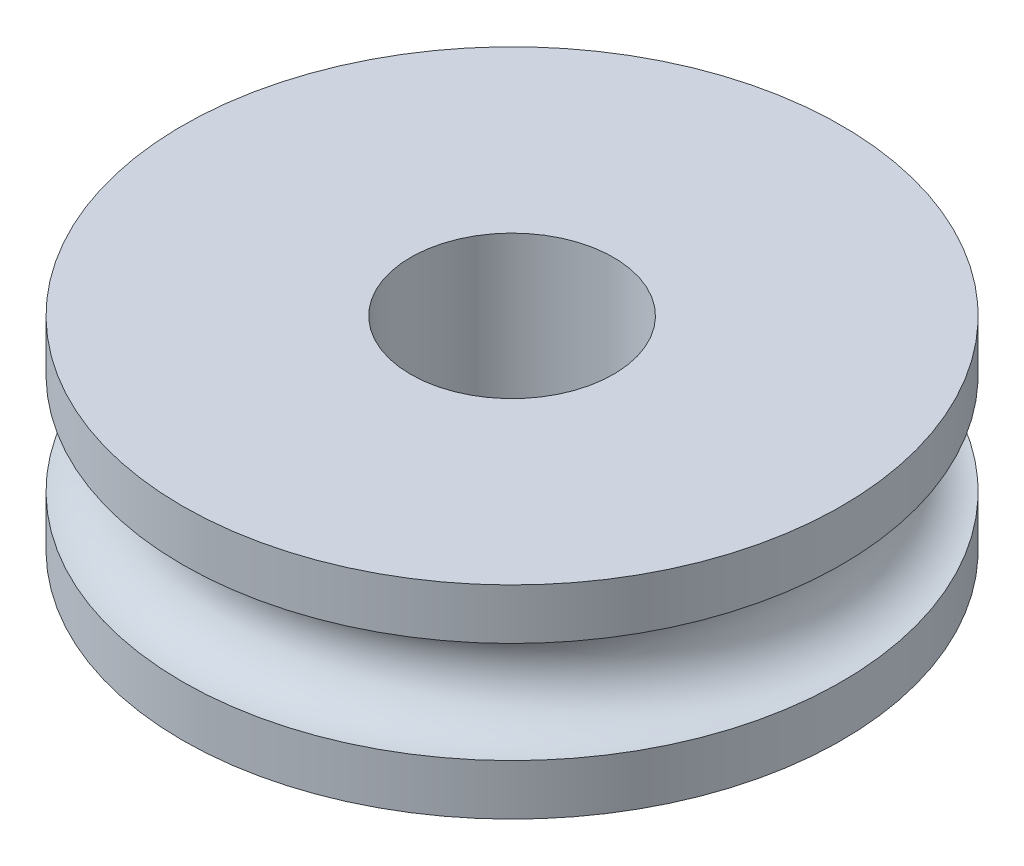
ISO-10303-21;
HEADER;
FILE_DESCRIPTION(('STEP AP214'),'2;1');
FILE_NAME('part.step','',(''),(''),'','','');
FILE_SCHEMA(('AUTOMOTIVE_DESIGN { 1 0 10303 214 1 1 1 1 }'));
ENDSEC;
DATA;
#1=APPLICATION_CONTEXT('core data for automotive mechanical design processes');
#2=APPLICATION_PROTOCOL_DEFINITION('international standard','automotive_design',2000,#1);
#3=PRODUCT_CONTEXT('',#1,'mechanical');
#4=PRODUCT('Part','Part','',(#3));
#5=PRODUCT_RELATED_PRODUCT_CATEGORY('part','',(#4));
#6=PRODUCT_DEFINITION_FORMATION('','',#4);
#7=PRODUCT_DEFINITION_CONTEXT('part definition',#1,'design');
#8=PRODUCT_DEFINITION('design','',#6,#7);
#9=PRODUCT_DEFINITION_SHAPE('','',#8);
#10=(LENGTH_UNIT() NAMED_UNIT(*) SI_UNIT(.MILLI.,.METRE.));
#11=(NAMED_UNIT(*) PLANE_ANGLE_UNIT() SI_UNIT($,.RADIAN.));
#12=(NAMED_UNIT(*) SI_UNIT($,.STERADIAN.) SOLID_ANGLE_UNIT());
#13=UNCERTAINTY_MEASURE_WITH_UNIT(LENGTH_MEASURE(1.E-05),#10,'distance_accuracy_value','');
#14=(GEOMETRIC_REPRESENTATION_CONTEXT(3) GLOBAL_UNCERTAINTY_ASSIGNED_CONTEXT((#13)) GLOBAL_UNIT_ASSIGNED_CONTEXT((#10,
#11,#12)) REPRESENTATION_CONTEXT('',''));
#15=CARTESIAN_POINT('',(0.,0.,0.));
#16=DIRECTION('',(0.,0.,1.));
#17=DIRECTION('',(1.,0.,0.));
#18=AXIS2_PLACEMENT_3D('',#15,#16,#17);
#19=CARTESIAN_POINT('',(74.5,50.02643198464,-44.43));
#20=DIRECTION('',(0.,1.,0.));
#21=DIRECTION('',(0.,0.,1.));
#22=AXIS2_PLACEMENT_3D('',#19,#20,#21);
#23=CYLINDRICAL_SURFACE('',#22,6.50000000000001);
#24=CARTESIAN_POINT('',(74.5,54.52643198464,-44.43));
#25=DIRECTION('',(0.,1.,0.));
#26=DIRECTION('',(0.,0.,1.));
#27=AXIS2_PLACEMENT_3D('',#24,#25,#26);
#28=CIRCLE('',#27,6.50000000000001);
#29=CARTESIAN_POINT('',(74.5,54.52643198464,-37.93));
#30=VERTEX_POINT('',#29);
#31=EDGE_CURVE('E17',#30,#30,#28,.F.);
#32=ORIENTED_EDGE('',*,*,#31,.T.);
#33=EDGE_LOOP('',(#32));
#34=FACE_BOUND('',#33,.T.);
#35=CARTESIAN_POINT('',(74.5,53.52643198464,-44.43));
#36=DIRECTION('',(0.,1.,0.));
#37=DIRECTION('',(0.,0.,1.));
#38=AXIS2_PLACEMENT_3D('',#35,#36,#37);
#39=CIRCLE('',#38,6.50000000000001);
#40=CARTESIAN_POINT('',(74.5,53.52643198464,-37.93));
#41=VERTEX_POINT('',#40);
#42=EDGE_CURVE('E29',#41,#41,#39,.T.);
#43=ORIENTED_EDGE('',*,*,#42,.T.);
#44=EDGE_LOOP('',(#43));
#45=FACE_BOUND('',#44,.T.);
#46=ADVANCED_FACE('F14',(#34,#45),#23,.T.);
#47=CARTESIAN_POINT('',(74.5,52.52643198464,-44.43));
#48=DIRECTION('',(0.,1.,0.));
#49=DIRECTION('',(1.,0.,0.));
#50=AXIS2_PLACEMENT_3D('',#47,#48,#49);
#51=TOROIDAL_SURFACE('',#50,6.50000000000001,1.);
#52=ORIENTED_EDGE('',*,*,#42,.F.);
#53=EDGE_LOOP('',(#52));
#54=FACE_BOUND('',#53,.T.);
#55=CARTESIAN_POINT('',(74.5,51.52643198464,-44.43));
#56=DIRECTION('',(0.,1.,0.));
#57=DIRECTION('',(0.,0.,1.));
#58=AXIS2_PLACEMENT_3D('',#55,#56,#57);
#59=CIRCLE('',#58,6.50000000000001);
#60=CARTESIAN_POINT('',(74.5,51.52643198464,-37.93));
#61=VERTEX_POINT('',#60);
#62=EDGE_CURVE('E32',#61,#61,#59,.F.);
#63=ORIENTED_EDGE('',*,*,#62,.F.);
#64=EDGE_LOOP('',(#63));
#65=FACE_BOUND('',#64,.T.);
#66=ADVANCED_FACE('F41',(#54,#65),#51,.F.);
#67=CARTESIAN_POINT('',(83.5,54.52643198464,-52.35926627001));
#68=DIRECTION('',(0.,-1.,0.));
#69=DIRECTION('',(0.,0.,-1.));
#70=AXIS2_PLACEMENT_3D('',#67,#68,#69);
#71=PLANE('',#70);
#72=CARTESIAN_POINT('',(74.5,54.52643198464,-44.43));
#73=DIRECTION('',(0.,1.,0.));
#74=DIRECTION('',(0.,0.,1.));
#75=AXIS2_PLACEMENT_3D('',#72,#73,#74);
#76=CIRCLE('',#75,2.);
#77=CARTESIAN_POINT('',(74.5,54.52643198464,-42.43));
#78=VERTEX_POINT('',#77);
#79=EDGE_CURVE('E26',#78,#78,#76,.F.);
#80=ORIENTED_EDGE('',*,*,#79,.T.);
#81=EDGE_LOOP('',(#80));
#82=FACE_BOUND('',#81,.T.);
#83=ORIENTED_EDGE('',*,*,#31,.F.);
#84=EDGE_LOOP('',(#83));
#85=FACE_BOUND('',#84,.T.);
#86=ADVANCED_FACE('F44',(#82,#85),#71,.F.);
#87=CARTESIAN_POINT('',(74.5,50.02643198464,-44.43));
#88=DIRECTION('',(0.,1.,0.));
#89=DIRECTION('',(0.,0.,1.));
#90=AXIS2_PLACEMENT_3D('',#87,#88,#89);
#91=CYLINDRICAL_SURFACE('',#90,6.50000000000001);
#92=CARTESIAN_POINT('',(74.5,50.52643198464,-44.43));
#93=DIRECTION('',(0.,1.,0.));
#94=DIRECTION('',(0.,0.,1.));
#95=AXIS2_PLACEMENT_3D('',#92,#93,#94);
#96=CIRCLE('',#95,6.50000000000001);
#97=CARTESIAN_POINT('',(74.5,50.52643198464,-37.93));
#98=VERTEX_POINT('',#97);
#99=EDGE_CURVE('E21',#98,#98,#96,.T.);
#100=ORIENTED_EDGE('',*,*,#99,.T.);
#101=EDGE_LOOP('',(#100));
#102=FACE_BOUND('',#101,.T.);
#103=ORIENTED_EDGE('',*,*,#62,.T.);
#104=EDGE_LOOP('',(#103));
#105=FACE_BOUND('',#104,.T.);
#106=ADVANCED_FACE('F48',(#102,#105),#91,.T.);
#107=CARTESIAN_POINT('',(74.5,50.02643198464,-44.43));
#108=DIRECTION('',(0.,1.,0.));
#109=DIRECTION('',(0.,0.,1.));
#110=AXIS2_PLACEMENT_3D('',#107,#108,#109);
#111=CYLINDRICAL_SURFACE('',#110,2.);
#112=CARTESIAN_POINT('',(74.5,50.52643198464,-44.43));
#113=DIRECTION('',(0.,1.,0.));
#114=DIRECTION('',(0.,0.,1.));
#115=AXIS2_PLACEMENT_3D('',#112,#113,#114);
#116=CIRCLE('',#115,2.);
#117=CARTESIAN_POINT('',(74.5,50.52643198464,-42.43));
#118=VERTEX_POINT('',#117);
#119=EDGE_CURVE('E10',#118,#118,#116,.F.);
#120=ORIENTED_EDGE('',*,*,#119,.T.);
#121=EDGE_LOOP('',(#120));
#122=FACE_BOUND('',#121,.T.);
#123=ORIENTED_EDGE('',*,*,#79,.F.);
#124=EDGE_LOOP('',(#123));
#125=FACE_BOUND('',#124,.T.);
#126=ADVANCED_FACE('F51',(#122,#125),#111,.F.);
#127=CARTESIAN_POINT('',(83.5,50.52643198464,-37.31836938706));
#128=DIRECTION('',(0.,1.,0.));
#129=DIRECTION('',(0.,0.,1.));
#130=AXIS2_PLACEMENT_3D('',#127,#128,#129);
#131=PLANE('',#130);
#132=ORIENTED_EDGE('',*,*,#119,.F.);
#133=EDGE_LOOP('',(#132));
#134=FACE_BOUND('',#133,.T.);
#135=ORIENTED_EDGE('',*,*,#99,.F.);
#136=EDGE_LOOP('',(#135));
#137=FACE_BOUND('',#136,.T.);
#138=ADVANCED_FACE('F55',(#134,#137),#131,.F.);
#139=CLOSED_SHELL('',(#46,#66,#86,#106,#126,#138));
#140=MANIFOLD_SOLID_BREP('B1',#139);
#141=ADVANCED_BREP_SHAPE_REPRESENTATION('',(#18,#140),#14);
#142=SHAPE_DEFINITION_REPRESENTATION(#9,#141);
ENDSEC;
END-ISO-10303-21;
